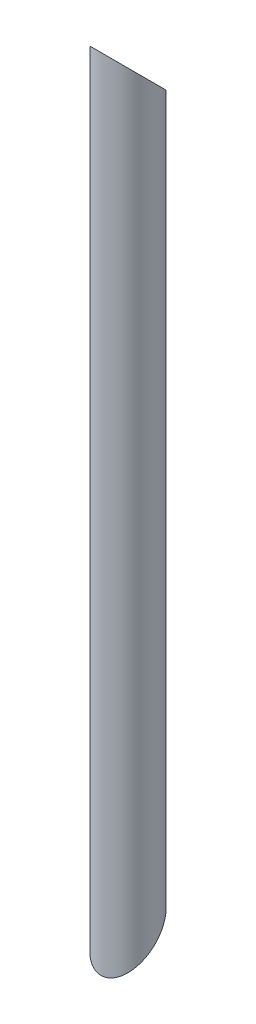
ISO-10303-21;
HEADER;
FILE_DESCRIPTION(('STEP AP214'),'2;1');
FILE_NAME('part.step','',(''),(''),'','','');
FILE_SCHEMA(('AUTOMOTIVE_DESIGN { 1 0 10303 214 1 1 1 1 }'));
ENDSEC;
DATA;
#1=APPLICATION_CONTEXT('core data for automotive mechanical design processes');
#2=APPLICATION_PROTOCOL_DEFINITION('international standard','automotive_design',2000,#1);
#3=PRODUCT_CONTEXT('',#1,'mechanical');
#4=PRODUCT('Part','Part','',(#3));
#5=PRODUCT_RELATED_PRODUCT_CATEGORY('part','',(#4));
#6=PRODUCT_DEFINITION_FORMATION('','',#4);
#7=PRODUCT_DEFINITION_CONTEXT('part definition',#1,'design');
#8=PRODUCT_DEFINITION('design','',#6,#7);
#9=PRODUCT_DEFINITION_SHAPE('','',#8);
#10=(LENGTH_UNIT() NAMED_UNIT(*) SI_UNIT(.MILLI.,.METRE.));
#11=(NAMED_UNIT(*) PLANE_ANGLE_UNIT() SI_UNIT($,.RADIAN.));
#12=(NAMED_UNIT(*) SI_UNIT($,.STERADIAN.) SOLID_ANGLE_UNIT());
#13=UNCERTAINTY_MEASURE_WITH_UNIT(LENGTH_MEASURE(1.E-05),#10,'distance_accuracy_value','');
#14=(GEOMETRIC_REPRESENTATION_CONTEXT(3) GLOBAL_UNCERTAINTY_ASSIGNED_CONTEXT((#13)) GLOBAL_UNIT_ASSIGNED_CONTEXT((#10,
#11,#12)) REPRESENTATION_CONTEXT('',''));
#15=CARTESIAN_POINT('',(0.,0.,0.));
#16=DIRECTION('',(0.,0.,1.));
#17=DIRECTION('',(1.,0.,0.));
#18=AXIS2_PLACEMENT_3D('',#15,#16,#17);
#19=CARTESIAN_POINT('',(-1.68322175520138E-13,350.,200.000000000003));
#20=DIRECTION('',(0.,-1.,0.));
#21=DIRECTION('',(0.,0.,1.));
#22=AXIS2_PLACEMENT_3D('',#19,#20,#21);
#23=CYLINDRICAL_SURFACE('',#22,9.65);
#24=CARTESIAN_POINT('',(-1.68322096110799E-13,0.,200.000000000003));
#25=DIRECTION('',(0.,-0.707106781186547,-0.707106781186548));
#26=DIRECTION('',(0.,-0.707106781186548,0.707106781186548));
#27=AXIS2_PLACEMENT_3D('',#24,#25,#26);
#28=ELLIPSE('',#27,13.6471608769004,9.65);
#29=CARTESIAN_POINT('',(-1.6832653499524E-13,-9.65000000000005,209.650000000003));
#30=VERTEX_POINT('',#29);
#31=EDGE_CURVE('E48',#30,#30,#28,.T.);
#32=ORIENTED_EDGE('',*,*,#31,.T.);
#33=EDGE_LOOP('',(#32));
#34=FACE_BOUND('',#33,.T.);
#35=CARTESIAN_POINT('',(-1.68322175520138E-13,350.,200.000000000003));
#36=DIRECTION('',(0.,0.707106781186548,-0.707106781186548));
#37=DIRECTION('',(0.,-0.707106781186548,-0.707106781186548));
#38=AXIS2_PLACEMENT_3D('',#35,#36,#37);
#39=ELLIPSE('',#38,13.6471608769004,9.65);
#40=CARTESIAN_POINT('',(-1.68319216263844E-13,340.35,190.350000000003));
#41=VERTEX_POINT('',#40);
#42=EDGE_CURVE('E61',#41,#41,#39,.T.);
#43=ORIENTED_EDGE('',*,*,#42,.T.);
#44=EDGE_LOOP('',(#43));
#45=FACE_BOUND('',#44,.T.);
#46=ADVANCED_FACE('F41',(#34,#45),#23,.F.);
#47=CARTESIAN_POINT('',(-1.67163752085649E-13,350.,200.000000000003));
#48=DIRECTION('',(0.,-0.707106781186548,0.707106781186548));
#49=DIRECTION('',(0.,0.707106781186548,0.707106781186548));
#50=AXIS2_PLACEMENT_3D('',#47,#48,#49);
#51=PLANE('',#50);
#52=ORIENTED_EDGE('',*,*,#42,.F.);
#53=EDGE_LOOP('',(#52));
#54=FACE_BOUND('',#53,.T.);
#55=CARTESIAN_POINT('',(-1.68322175520138E-13,350.,200.000000000003));
#56=DIRECTION('',(0.,0.707106781186548,-0.707106781186548));
#57=DIRECTION('',(0.,-0.707106781186548,-0.707106781186548));
#58=AXIS2_PLACEMENT_3D('',#55,#56,#57);
#59=ELLIPSE('',#58,17.9605122421383,12.7);
#60=CARTESIAN_POINT('',(-1.68318280954859E-13,337.3,187.300000000003));
#61=VERTEX_POINT('',#60);
#62=EDGE_CURVE('E54',#61,#61,#59,.T.);
#63=ORIENTED_EDGE('',*,*,#62,.T.);
#64=EDGE_LOOP('',(#63));
#65=FACE_BOUND('',#64,.T.);
#66=ADVANCED_FACE('F69',(#54,#65),#51,.F.);
#67=CARTESIAN_POINT('',(-1.68322175520138E-13,350.,200.000000000003));
#68=DIRECTION('',(0.,-1.,0.));
#69=DIRECTION('',(0.,0.,1.));
#70=AXIS2_PLACEMENT_3D('',#67,#68,#69);
#71=CYLINDRICAL_SURFACE('',#70,12.7);
#72=CARTESIAN_POINT('',(-1.68322096110799E-13,0.,200.000000000003));
#73=DIRECTION('',(0.,-0.707106781186547,-0.707106781186548));
#74=DIRECTION('',(0.,-0.707106781186548,0.707106781186548));
#75=AXIS2_PLACEMENT_3D('',#72,#73,#74);
#76=ELLIPSE('',#75,17.9605122421383,12.7);
#77=CARTESIAN_POINT('',(-1.68327937958717E-13,-12.7000000000001,212.700000000003));
#78=VERTEX_POINT('',#77);
#79=EDGE_CURVE('E10',#78,#78,#76,.T.);
#80=ORIENTED_EDGE('',*,*,#79,.F.);
#81=EDGE_LOOP('',(#80));
#82=FACE_BOUND('',#81,.T.);
#83=ORIENTED_EDGE('',*,*,#62,.F.);
#84=EDGE_LOOP('',(#83));
#85=FACE_BOUND('',#84,.T.);
#86=ADVANCED_FACE('F72',(#82,#85),#71,.T.);
#87=CARTESIAN_POINT('',(-1.67163831494988E-13,0.,200.000000000003));
#88=DIRECTION('',(0.,0.707106781186547,0.707106781186548));
#89=DIRECTION('',(0.,0.707106781186548,-0.707106781186548));
#90=AXIS2_PLACEMENT_3D('',#87,#88,#89);
#91=PLANE('',#90);
#92=ORIENTED_EDGE('',*,*,#31,.F.);
#93=EDGE_LOOP('',(#92));
#94=FACE_BOUND('',#93,.T.);
#95=ORIENTED_EDGE('',*,*,#79,.T.);
#96=EDGE_LOOP('',(#95));
#97=FACE_BOUND('',#96,.T.);
#98=ADVANCED_FACE('F77',(#94,#97),#91,.F.);
#99=CLOSED_SHELL('',(#46,#66,#86,#98));
#100=MANIFOLD_SOLID_BREP('B2',#99);
#101=ADVANCED_BREP_SHAPE_REPRESENTATION('',(#18,#100),#14);
#102=SHAPE_DEFINITION_REPRESENTATION(#9,#101);
ENDSEC;
END-ISO-10303-21;
